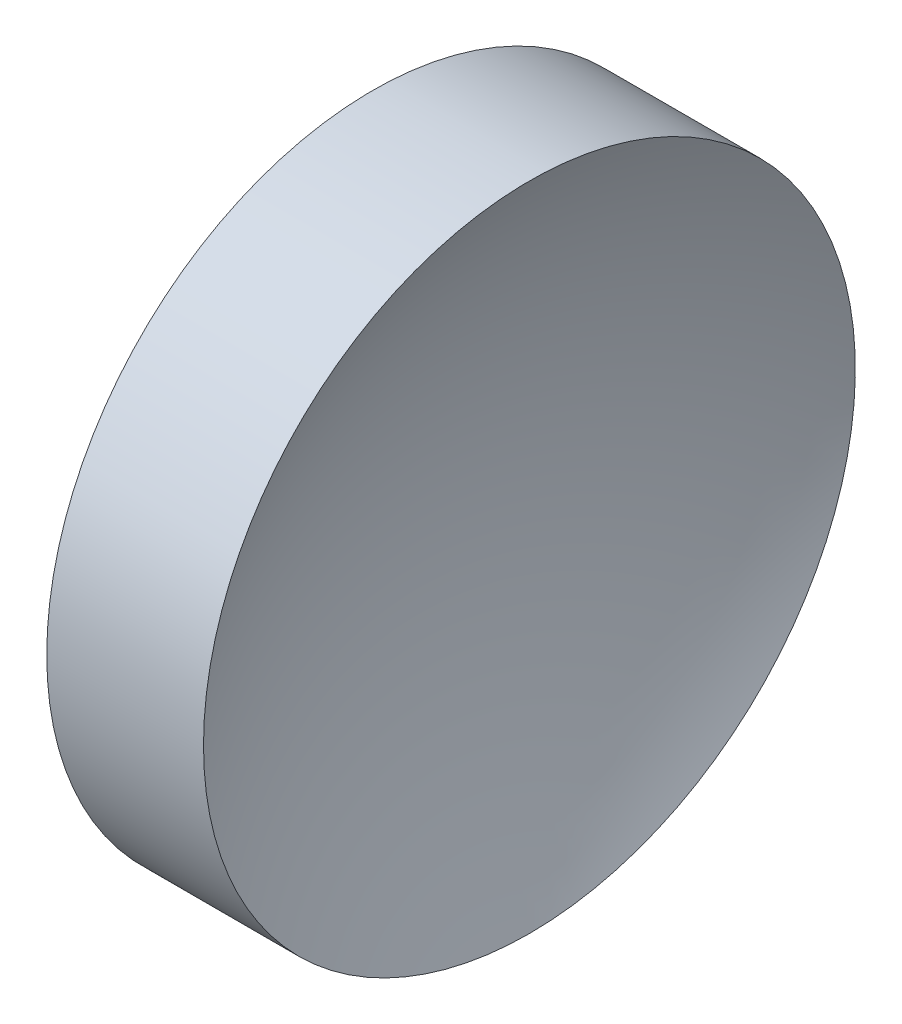
ISO-10303-21;
HEADER;
FILE_DESCRIPTION(('STEP AP214'),'2;1');
FILE_NAME('part.step','',(''),(''),'','','');
FILE_SCHEMA(('AUTOMOTIVE_DESIGN { 1 0 10303 214 1 1 1 1 }'));
ENDSEC;
DATA;
#1=APPLICATION_CONTEXT('core data for automotive mechanical design processes');
#2=APPLICATION_PROTOCOL_DEFINITION('international standard','automotive_design',2000,#1);
#3=PRODUCT_CONTEXT('',#1,'mechanical');
#4=PRODUCT('Part','Part','',(#3));
#5=PRODUCT_RELATED_PRODUCT_CATEGORY('part','',(#4));
#6=PRODUCT_DEFINITION_FORMATION('','',#4);
#7=PRODUCT_DEFINITION_CONTEXT('part definition',#1,'design');
#8=PRODUCT_DEFINITION('design','',#6,#7);
#9=PRODUCT_DEFINITION_SHAPE('','',#8);
#10=(LENGTH_UNIT() NAMED_UNIT(*) SI_UNIT(.MILLI.,.METRE.));
#11=(NAMED_UNIT(*) PLANE_ANGLE_UNIT() SI_UNIT($,.RADIAN.));
#12=(NAMED_UNIT(*) SI_UNIT($,.STERADIAN.) SOLID_ANGLE_UNIT());
#13=UNCERTAINTY_MEASURE_WITH_UNIT(LENGTH_MEASURE(1.E-05),#10,'distance_accuracy_value','');
#14=(GEOMETRIC_REPRESENTATION_CONTEXT(3) GLOBAL_UNCERTAINTY_ASSIGNED_CONTEXT((#13)) GLOBAL_UNIT_ASSIGNED_CONTEXT((#10,
#11,#12)) REPRESENTATION_CONTEXT('',''));
#15=CARTESIAN_POINT('',(0.,0.,0.));
#16=DIRECTION('',(0.,0.,1.));
#17=DIRECTION('',(1.,0.,0.));
#18=AXIS2_PLACEMENT_3D('',#15,#16,#17);
#19=CARTESIAN_POINT('',(63.0037085014825,28.4775956346375,0.));
#20=DIRECTION('',(-1.,0.,0.));
#21=DIRECTION('',(0.,-1.,0.));
#22=AXIS2_PLACEMENT_3D('',#19,#20,#21);
#23=SPHERICAL_SURFACE('',#22,13.75);
#24=CARTESIAN_POINT('',(50.8078075507532,28.4775956346375,0.));
#25=DIRECTION('',(-1.,0.,0.));
#26=DIRECTION('',(0.,0.,1.));
#27=AXIS2_PLACEMENT_3D('',#24,#25,#26);
#28=CIRCLE('',#27,6.35000000000001);
#29=CARTESIAN_POINT('',(50.8078075507532,28.4775956346375,6.35000000000001));
#30=VERTEX_POINT('',#29);
#31=EDGE_CURVE('E10',#30,#30,#28,.T.);
#32=ORIENTED_EDGE('',*,*,#31,.F.);
#33=EDGE_LOOP('',(#32));
#34=FACE_BOUND('',#33,.T.);
#35=ADVANCED_FACE('F35',(#34),#23,.F.);
#36=CARTESIAN_POINT('',(44.7820919030242,28.4775956346375,0.));
#37=DIRECTION('',(-1.,0.,0.));
#38=DIRECTION('',(0.,0.,1.));
#39=AXIS2_PLACEMENT_3D('',#36,#37,#38);
#40=CYLINDRICAL_SURFACE('',#39,6.35);
#41=CARTESIAN_POINT('',(47.7537085014825,28.4775956346375,0.));
#42=DIRECTION('',(-1.,0.,0.));
#43=DIRECTION('',(0.,0.,1.));
#44=AXIS2_PLACEMENT_3D('',#41,#42,#43);
#45=CIRCLE('',#44,6.35);
#46=CARTESIAN_POINT('',(47.7537085014825,28.4775956346375,6.35));
#47=VERTEX_POINT('',#46);
#48=EDGE_CURVE('E41',#47,#47,#45,.T.);
#49=ORIENTED_EDGE('',*,*,#48,.F.);
#50=EDGE_LOOP('',(#49));
#51=FACE_BOUND('',#50,.T.);
#52=ORIENTED_EDGE('',*,*,#31,.T.);
#53=EDGE_LOOP('',(#52));
#54=FACE_BOUND('',#53,.T.);
#55=ADVANCED_FACE('F49',(#51,#54),#40,.T.);
#56=CARTESIAN_POINT('',(47.7537085014825,28.4775956346375,0.));
#57=DIRECTION('',(1.,0.,0.));
#58=DIRECTION('',(0.,0.,-1.));
#59=AXIS2_PLACEMENT_3D('',#56,#57,#58);
#60=PLANE('',#59);
#61=ORIENTED_EDGE('',*,*,#48,.T.);
#62=EDGE_LOOP('',(#61));
#63=FACE_BOUND('',#62,.T.);
#64=ADVANCED_FACE('F47',(#63),#60,.F.);
#65=CLOSED_SHELL('',(#35,#55,#64));
#66=MANIFOLD_SOLID_BREP('B2',#65);
#67=ADVANCED_BREP_SHAPE_REPRESENTATION('',(#18,#66),#14);
#68=SHAPE_DEFINITION_REPRESENTATION(#9,#67);
ENDSEC;
END-ISO-10303-21;
